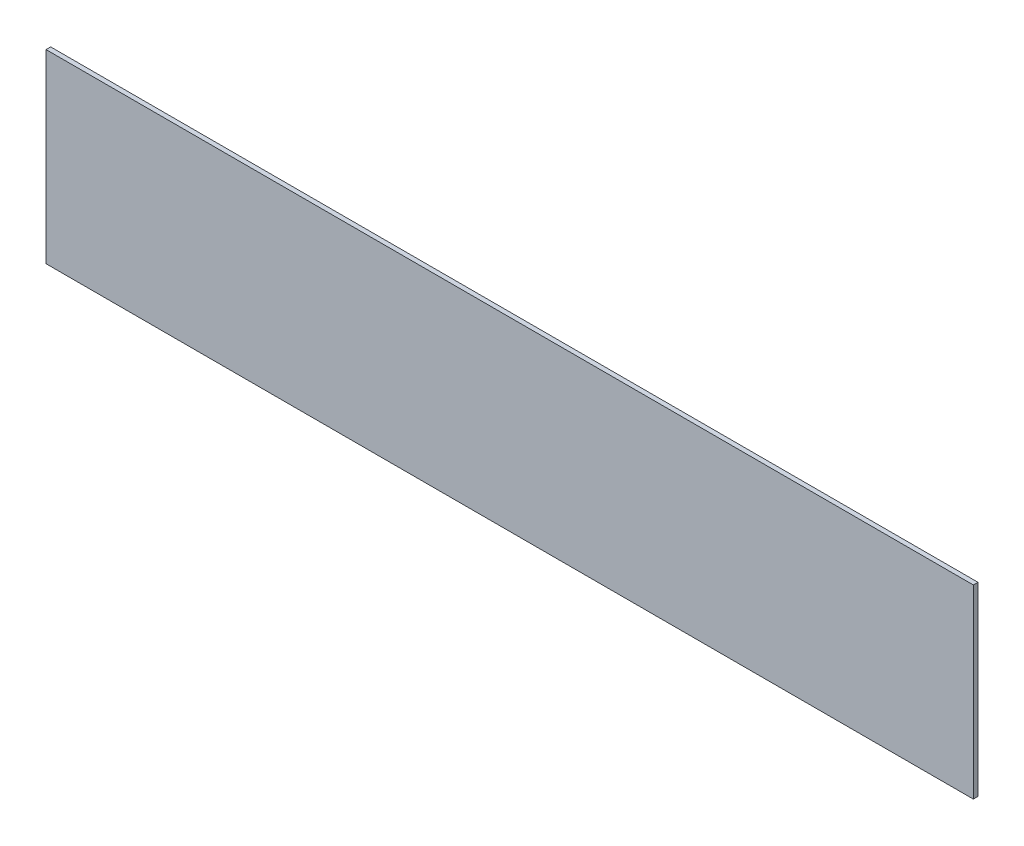
ISO-10303-21;
HEADER;
FILE_DESCRIPTION(('STEP AP214'),'2;1');
FILE_NAME('part.step','',(''),(''),'','','');
FILE_SCHEMA(('AUTOMOTIVE_DESIGN { 1 0 10303 214 1 1 1 1 }'));
ENDSEC;
DATA;
#1=APPLICATION_CONTEXT('core data for automotive mechanical design processes');
#2=APPLICATION_PROTOCOL_DEFINITION('international standard','automotive_design',2000,#1);
#3=PRODUCT_CONTEXT('',#1,'mechanical');
#4=PRODUCT('Part','Part','',(#3));
#5=PRODUCT_RELATED_PRODUCT_CATEGORY('part','',(#4));
#6=PRODUCT_DEFINITION_FORMATION('','',#4);
#7=PRODUCT_DEFINITION_CONTEXT('part definition',#1,'design');
#8=PRODUCT_DEFINITION('design','',#6,#7);
#9=PRODUCT_DEFINITION_SHAPE('','',#8);
#10=(LENGTH_UNIT() NAMED_UNIT(*) SI_UNIT(.MILLI.,.METRE.));
#11=(NAMED_UNIT(*) PLANE_ANGLE_UNIT() SI_UNIT($,.RADIAN.));
#12=(NAMED_UNIT(*) SI_UNIT($,.STERADIAN.) SOLID_ANGLE_UNIT());
#13=UNCERTAINTY_MEASURE_WITH_UNIT(LENGTH_MEASURE(1.E-05),#10,'distance_accuracy_value','');
#14=(GEOMETRIC_REPRESENTATION_CONTEXT(3) GLOBAL_UNCERTAINTY_ASSIGNED_CONTEXT((#13)) GLOBAL_UNIT_ASSIGNED_CONTEXT((#10,
#11,#12)) REPRESENTATION_CONTEXT('',''));
#15=CARTESIAN_POINT('',(0.,0.,0.));
#16=DIRECTION('',(0.,0.,1.));
#17=DIRECTION('',(1.,0.,0.));
#18=AXIS2_PLACEMENT_3D('',#15,#16,#17);
#19=CARTESIAN_POINT('',(-54.9212598425197,-30.8858267716535,1.5));
#20=DIRECTION('',(1.,0.,0.));
#21=DIRECTION('',(0.,0.,-1.));
#22=AXIS2_PLACEMENT_3D('',#19,#20,#21);
#23=PLANE('',#22);
#24=DIRECTION('',(0.,-1.,0.));
#25=VECTOR('',#24,1.);
#26=CARTESIAN_POINT('',(-54.9212598425197,-30.8858267716535,0.));
#27=LINE('',#26,#25);
#28=CARTESIAN_POINT('',(-54.9212598425197,29.1141732283465,0.));
#29=VERTEX_POINT('',#28);
#30=CARTESIAN_POINT('',(-54.9212598425197,-30.8858267716535,0.));
#31=VERTEX_POINT('',#30);
#32=EDGE_CURVE('E99',#29,#31,#27,.T.);
#33=ORIENTED_EDGE('',*,*,#32,.T.);
#34=DIRECTION('',(0.,0.,-1.));
#35=VECTOR('',#34,1.);
#36=CARTESIAN_POINT('',(-54.9212598425197,-30.8858267716535,1.5));
#37=LINE('',#36,#35);
#38=CARTESIAN_POINT('',(-54.9212598425197,-30.8858267716535,1.5));
#39=VERTEX_POINT('',#38);
#40=EDGE_CURVE('E11',#39,#31,#37,.T.);
#41=ORIENTED_EDGE('',*,*,#40,.F.);
#42=DIRECTION('',(0.,-1.,0.));
#43=VECTOR('',#42,1.);
#44=CARTESIAN_POINT('',(-54.9212598425197,-30.8858267716535,1.5));
#45=LINE('',#44,#43);
#46=CARTESIAN_POINT('',(-54.9212598425197,29.1141732283465,1.5));
#47=VERTEX_POINT('',#46);
#48=EDGE_CURVE('E87',#47,#39,#45,.T.);
#49=ORIENTED_EDGE('',*,*,#48,.F.);
#50=DIRECTION('',(0.,0.,-1.));
#51=VECTOR('',#50,1.);
#52=CARTESIAN_POINT('',(-54.9212598425197,29.1141732283465,1.5));
#53=LINE('',#52,#51);
#54=EDGE_CURVE('E95',#47,#29,#53,.T.);
#55=ORIENTED_EDGE('',*,*,#54,.T.);
#56=EDGE_LOOP('',(#33,#41,#49,#55));
#57=FACE_BOUND('',#56,.T.);
#58=ADVANCED_FACE('F36',(#57),#23,.F.);
#59=CARTESIAN_POINT('',(245.07874015748,-30.8858267716535,1.5));
#60=DIRECTION('',(0.,1.,0.));
#61=DIRECTION('',(-1.,0.,0.));
#62=AXIS2_PLACEMENT_3D('',#59,#60,#61);
#63=PLANE('',#62);
#64=DIRECTION('',(1.,0.,0.));
#65=VECTOR('',#64,1.);
#66=CARTESIAN_POINT('',(245.07874015748,-30.8858267716535,0.));
#67=LINE('',#66,#65);
#68=CARTESIAN_POINT('',(245.07874015748,-30.8858267716535,0.));
#69=VERTEX_POINT('',#68);
#70=EDGE_CURVE('E91',#31,#69,#67,.T.);
#71=ORIENTED_EDGE('',*,*,#70,.T.);
#72=DIRECTION('',(0.,0.,-1.));
#73=VECTOR('',#72,1.);
#74=CARTESIAN_POINT('',(245.07874015748,-30.8858267716535,1.5));
#75=LINE('',#74,#73);
#76=CARTESIAN_POINT('',(245.07874015748,-30.8858267716535,1.5));
#77=VERTEX_POINT('',#76);
#78=EDGE_CURVE('E44',#77,#69,#75,.T.);
#79=ORIENTED_EDGE('',*,*,#78,.F.);
#80=DIRECTION('',(1.,0.,0.));
#81=VECTOR('',#80,1.);
#82=CARTESIAN_POINT('',(245.07874015748,-30.8858267716535,1.5));
#83=LINE('',#82,#81);
#84=EDGE_CURVE('E82',#39,#77,#83,.T.);
#85=ORIENTED_EDGE('',*,*,#84,.F.);
#86=ORIENTED_EDGE('',*,*,#40,.T.);
#87=EDGE_LOOP('',(#71,#79,#85,#86));
#88=FACE_BOUND('',#87,.T.);
#89=ADVANCED_FACE('F90',(#88),#63,.F.);
#90=CARTESIAN_POINT('',(245.07874015748,-30.8858267716535,1.5));
#91=DIRECTION('',(-1.,0.,0.));
#92=DIRECTION('',(0.,0.,1.));
#93=AXIS2_PLACEMENT_3D('',#90,#91,#92);
#94=PLANE('',#93);
#95=DIRECTION('',(0.,1.,0.));
#96=VECTOR('',#95,1.);
#97=CARTESIAN_POINT('',(245.07874015748,-30.8858267716535,0.));
#98=LINE('',#97,#96);
#99=CARTESIAN_POINT('',(245.07874015748,29.1141732283465,0.));
#100=VERTEX_POINT('',#99);
#101=EDGE_CURVE('E69',#69,#100,#98,.T.);
#102=ORIENTED_EDGE('',*,*,#101,.T.);
#103=DIRECTION('',(0.,0.,-1.));
#104=VECTOR('',#103,1.);
#105=CARTESIAN_POINT('',(245.07874015748,29.1141732283465,1.5));
#106=LINE('',#105,#104);
#107=CARTESIAN_POINT('',(245.07874015748,29.1141732283465,1.5));
#108=VERTEX_POINT('',#107);
#109=EDGE_CURVE('E92',#108,#100,#106,.T.);
#110=ORIENTED_EDGE('',*,*,#109,.F.);
#111=DIRECTION('',(0.,1.,0.));
#112=VECTOR('',#111,1.);
#113=CARTESIAN_POINT('',(245.07874015748,-30.8858267716535,1.5));
#114=LINE('',#113,#112);
#115=EDGE_CURVE('E85',#77,#108,#114,.T.);
#116=ORIENTED_EDGE('',*,*,#115,.F.);
#117=ORIENTED_EDGE('',*,*,#78,.T.);
#118=EDGE_LOOP('',(#102,#110,#116,#117));
#119=FACE_BOUND('',#118,.T.);
#120=ADVANCED_FACE('F93',(#119),#94,.F.);
#121=CARTESIAN_POINT('',(245.07874015748,29.1141732283465,1.5));
#122=DIRECTION('',(0.,-1.,0.));
#123=DIRECTION('',(1.,0.,0.));
#124=AXIS2_PLACEMENT_3D('',#121,#122,#123);
#125=PLANE('',#124);
#126=DIRECTION('',(-1.,0.,0.));
#127=VECTOR('',#126,1.);
#128=CARTESIAN_POINT('',(245.07874015748,29.1141732283465,0.));
#129=LINE('',#128,#127);
#130=EDGE_CURVE('E75',#100,#29,#129,.T.);
#131=ORIENTED_EDGE('',*,*,#130,.T.);
#132=ORIENTED_EDGE('',*,*,#54,.F.);
#133=DIRECTION('',(-1.,0.,0.));
#134=VECTOR('',#133,1.);
#135=CARTESIAN_POINT('',(245.07874015748,29.1141732283465,1.5));
#136=LINE('',#135,#134);
#137=EDGE_CURVE('E52',#108,#47,#136,.T.);
#138=ORIENTED_EDGE('',*,*,#137,.F.);
#139=ORIENTED_EDGE('',*,*,#109,.T.);
#140=EDGE_LOOP('',(#131,#132,#138,#139));
#141=FACE_BOUND('',#140,.T.);
#142=ADVANCED_FACE('F106',(#141),#125,.F.);
#143=CARTESIAN_POINT('',(0.,0.,1.5));
#144=DIRECTION('',(0.,0.,1.));
#145=DIRECTION('',(1.,0.,0.));
#146=AXIS2_PLACEMENT_3D('',#143,#144,#145);
#147=PLANE('',#146);
#148=ORIENTED_EDGE('',*,*,#48,.T.);
#149=ORIENTED_EDGE('',*,*,#84,.T.);
#150=ORIENTED_EDGE('',*,*,#115,.T.);
#151=ORIENTED_EDGE('',*,*,#137,.T.);
#152=EDGE_LOOP('',(#148,#149,#150,#151));
#153=FACE_BOUND('',#152,.T.);
#154=ADVANCED_FACE('F83',(#153),#147,.T.);
#155=CARTESIAN_POINT('',(0.,0.,0.));
#156=DIRECTION('',(0.,0.,1.));
#157=DIRECTION('',(1.,0.,0.));
#158=AXIS2_PLACEMENT_3D('',#155,#156,#157);
#159=PLANE('',#158);
#160=ORIENTED_EDGE('',*,*,#32,.F.);
#161=ORIENTED_EDGE('',*,*,#130,.F.);
#162=ORIENTED_EDGE('',*,*,#101,.F.);
#163=ORIENTED_EDGE('',*,*,#70,.F.);
#164=EDGE_LOOP('',(#160,#161,#162,#163));
#165=FACE_BOUND('',#164,.T.);
#166=ADVANCED_FACE('F109',(#165),#159,.F.);
#167=CLOSED_SHELL('',(#58,#89,#120,#142,#154,#166));
#168=MANIFOLD_SOLID_BREP('B2',#167);
#169=ADVANCED_BREP_SHAPE_REPRESENTATION('',(#18,#168),#14);
#170=SHAPE_DEFINITION_REPRESENTATION(#9,#169);
ENDSEC;
END-ISO-10303-21;
